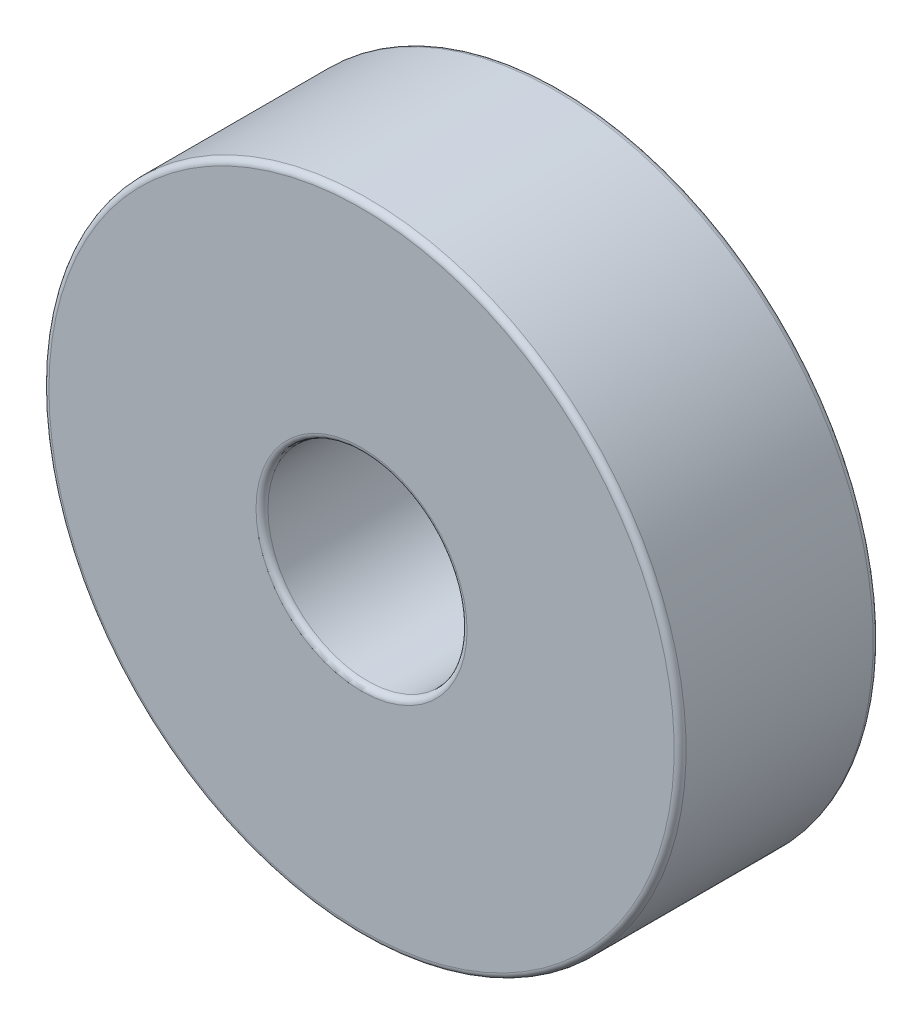
ISO-10303-21;
HEADER;
FILE_DESCRIPTION(('STEP AP214'),'2;1');
FILE_NAME('part.step','',(''),(''),'','','');
FILE_SCHEMA(('AUTOMOTIVE_DESIGN { 1 0 10303 214 1 1 1 1 }'));
ENDSEC;
DATA;
#1=APPLICATION_CONTEXT('core data for automotive mechanical design processes');
#2=APPLICATION_PROTOCOL_DEFINITION('international standard','automotive_design',2000,#1);
#3=PRODUCT_CONTEXT('',#1,'mechanical');
#4=PRODUCT('Part','Part','',(#3));
#5=PRODUCT_RELATED_PRODUCT_CATEGORY('part','',(#4));
#6=PRODUCT_DEFINITION_FORMATION('','',#4);
#7=PRODUCT_DEFINITION_CONTEXT('part definition',#1,'design');
#8=PRODUCT_DEFINITION('design','',#6,#7);
#9=PRODUCT_DEFINITION_SHAPE('','',#8);
#10=(LENGTH_UNIT() NAMED_UNIT(*) SI_UNIT(.MILLI.,.METRE.));
#11=(NAMED_UNIT(*) PLANE_ANGLE_UNIT() SI_UNIT($,.RADIAN.));
#12=(NAMED_UNIT(*) SI_UNIT($,.STERADIAN.) SOLID_ANGLE_UNIT());
#13=UNCERTAINTY_MEASURE_WITH_UNIT(LENGTH_MEASURE(1.E-05),#10,'distance_accuracy_value','');
#14=(GEOMETRIC_REPRESENTATION_CONTEXT(3) GLOBAL_UNCERTAINTY_ASSIGNED_CONTEXT((#13)) GLOBAL_UNIT_ASSIGNED_CONTEXT((#10,
#11,#12)) REPRESENTATION_CONTEXT('',''));
#15=CARTESIAN_POINT('',(0.,0.,0.));
#16=DIRECTION('',(0.,0.,1.));
#17=DIRECTION('',(1.,0.,0.));
#18=AXIS2_PLACEMENT_3D('',#15,#16,#17);
#19=CARTESIAN_POINT('',(0.,0.,-0.15));
#20=DIRECTION('',(0.,0.,-1.));
#21=DIRECTION('',(-1.,0.,0.));
#22=AXIS2_PLACEMENT_3D('',#19,#20,#21);
#23=TOROIDAL_SURFACE('',#22,2.65,0.15);
#24=CARTESIAN_POINT('',(0.,0.,-0.15));
#25=DIRECTION('',(0.,0.,-1.));
#26=DIRECTION('',(-1.,0.,0.));
#27=AXIS2_PLACEMENT_3D('',#24,#25,#26);
#28=CIRCLE('',#27,2.5);
#29=CARTESIAN_POINT('',(-2.5,0.,-0.15));
#30=VERTEX_POINT('',#29);
#31=EDGE_CURVE('E59',#30,#30,#28,.T.);
#32=ORIENTED_EDGE('',*,*,#31,.T.);
#33=EDGE_LOOP('',(#32));
#34=FACE_BOUND('',#33,.T.);
#35=CARTESIAN_POINT('',(0.,0.,0.));
#36=DIRECTION('',(0.,0.,-1.));
#37=DIRECTION('',(-1.,0.,0.));
#38=AXIS2_PLACEMENT_3D('',#35,#36,#37);
#39=CIRCLE('',#38,2.65);
#40=CARTESIAN_POINT('',(-2.65,0.,0.));
#41=VERTEX_POINT('',#40);
#42=EDGE_CURVE('E10',#41,#41,#39,.T.);
#43=ORIENTED_EDGE('',*,*,#42,.F.);
#44=EDGE_LOOP('',(#43));
#45=FACE_BOUND('',#44,.T.);
#46=ADVANCED_FACE('F31',(#34,#45),#23,.T.);
#47=CARTESIAN_POINT('',(0.,7.85,0.));
#48=DIRECTION('',(0.,0.,1.));
#49=DIRECTION('',(1.,0.,0.));
#50=AXIS2_PLACEMENT_3D('',#47,#48,#49);
#51=PLANE('',#50);
#52=ORIENTED_EDGE('',*,*,#42,.T.);
#53=EDGE_LOOP('',(#52));
#54=FACE_BOUND('',#53,.T.);
#55=CARTESIAN_POINT('',(0.,0.,0.));
#56=DIRECTION('',(0.,0.,-1.));
#57=DIRECTION('',(-1.,0.,0.));
#58=AXIS2_PLACEMENT_3D('',#55,#56,#57);
#59=CIRCLE('',#58,7.85);
#60=CARTESIAN_POINT('',(-7.85,0.,0.));
#61=VERTEX_POINT('',#60);
#62=EDGE_CURVE('E37',#61,#61,#59,.T.);
#63=ORIENTED_EDGE('',*,*,#62,.F.);
#64=EDGE_LOOP('',(#63));
#65=FACE_BOUND('',#64,.T.);
#66=ADVANCED_FACE('F77',(#54,#65),#51,.T.);
#67=CARTESIAN_POINT('',(0.,0.,-0.15));
#68=DIRECTION('',(0.,0.,-1.));
#69=DIRECTION('',(-1.,0.,0.));
#70=AXIS2_PLACEMENT_3D('',#67,#68,#69);
#71=TOROIDAL_SURFACE('',#70,7.85,0.150000000000001);
#72=ORIENTED_EDGE('',*,*,#62,.T.);
#73=EDGE_LOOP('',(#72));
#74=FACE_BOUND('',#73,.T.);
#75=CARTESIAN_POINT('',(0.,0.,-0.15));
#76=DIRECTION('',(0.,0.,-1.));
#77=DIRECTION('',(-1.,0.,0.));
#78=AXIS2_PLACEMENT_3D('',#75,#76,#77);
#79=CIRCLE('',#78,8.);
#80=CARTESIAN_POINT('',(-8.,0.,-0.15));
#81=VERTEX_POINT('',#80);
#82=EDGE_CURVE('E41',#81,#81,#79,.T.);
#83=ORIENTED_EDGE('',*,*,#82,.F.);
#84=EDGE_LOOP('',(#83));
#85=FACE_BOUND('',#84,.T.);
#86=ADVANCED_FACE('F81',(#74,#85),#71,.T.);
#87=CARTESIAN_POINT('',(0.,0.,0.));
#88=DIRECTION('',(0.,0.,-1.));
#89=DIRECTION('',(-1.,0.,0.));
#90=AXIS2_PLACEMENT_3D('',#87,#88,#89);
#91=CYLINDRICAL_SURFACE('',#90,8.);
#92=ORIENTED_EDGE('',*,*,#82,.T.);
#93=EDGE_LOOP('',(#92));
#94=FACE_BOUND('',#93,.T.);
#95=CARTESIAN_POINT('',(0.,0.,-4.85));
#96=DIRECTION('',(0.,0.,-1.));
#97=DIRECTION('',(-1.,0.,0.));
#98=AXIS2_PLACEMENT_3D('',#95,#96,#97);
#99=CIRCLE('',#98,8.);
#100=CARTESIAN_POINT('',(-8.,0.,-4.85));
#101=VERTEX_POINT('',#100);
#102=EDGE_CURVE('E45',#101,#101,#99,.T.);
#103=ORIENTED_EDGE('',*,*,#102,.F.);
#104=EDGE_LOOP('',(#103));
#105=FACE_BOUND('',#104,.T.);
#106=ADVANCED_FACE('F85',(#94,#105),#91,.T.);
#107=CARTESIAN_POINT('',(0.,0.,-4.85));
#108=DIRECTION('',(0.,0.,-1.));
#109=DIRECTION('',(-1.,0.,0.));
#110=AXIS2_PLACEMENT_3D('',#107,#108,#109);
#111=TOROIDAL_SURFACE('',#110,7.85,0.15);
#112=ORIENTED_EDGE('',*,*,#102,.T.);
#113=EDGE_LOOP('',(#112));
#114=FACE_BOUND('',#113,.T.);
#115=CARTESIAN_POINT('',(0.,0.,-5.));
#116=DIRECTION('',(0.,0.,-1.));
#117=DIRECTION('',(-1.,0.,0.));
#118=AXIS2_PLACEMENT_3D('',#115,#116,#117);
#119=CIRCLE('',#118,7.85);
#120=CARTESIAN_POINT('',(-7.85,0.,-5.));
#121=VERTEX_POINT('',#120);
#122=EDGE_CURVE('E50',#121,#121,#119,.T.);
#123=ORIENTED_EDGE('',*,*,#122,.F.);
#124=EDGE_LOOP('',(#123));
#125=FACE_BOUND('',#124,.T.);
#126=ADVANCED_FACE('F91',(#114,#125),#111,.T.);
#127=CARTESIAN_POINT('',(0.,2.65,-5.));
#128=DIRECTION('',(0.,0.,-1.));
#129=DIRECTION('',(-1.,0.,0.));
#130=AXIS2_PLACEMENT_3D('',#127,#128,#129);
#131=PLANE('',#130);
#132=ORIENTED_EDGE('',*,*,#122,.T.);
#133=EDGE_LOOP('',(#132));
#134=FACE_BOUND('',#133,.T.);
#135=CARTESIAN_POINT('',(0.,0.,-5.));
#136=DIRECTION('',(0.,0.,-1.));
#137=DIRECTION('',(-1.,0.,0.));
#138=AXIS2_PLACEMENT_3D('',#135,#136,#137);
#139=CIRCLE('',#138,2.65);
#140=CARTESIAN_POINT('',(-2.65,0.,-5.));
#141=VERTEX_POINT('',#140);
#142=EDGE_CURVE('E53',#141,#141,#139,.T.);
#143=ORIENTED_EDGE('',*,*,#142,.F.);
#144=EDGE_LOOP('',(#143));
#145=FACE_BOUND('',#144,.T.);
#146=ADVANCED_FACE('F73',(#134,#145),#131,.T.);
#147=CARTESIAN_POINT('',(0.,0.,-4.85));
#148=DIRECTION('',(0.,0.,-1.));
#149=DIRECTION('',(-1.,0.,0.));
#150=AXIS2_PLACEMENT_3D('',#147,#148,#149);
#151=TOROIDAL_SURFACE('',#150,2.65,0.15);
#152=ORIENTED_EDGE('',*,*,#142,.T.);
#153=EDGE_LOOP('',(#152));
#154=FACE_BOUND('',#153,.T.);
#155=CARTESIAN_POINT('',(0.,0.,-4.85));
#156=DIRECTION('',(0.,0.,-1.));
#157=DIRECTION('',(-1.,0.,0.));
#158=AXIS2_PLACEMENT_3D('',#155,#156,#157);
#159=CIRCLE('',#158,2.5);
#160=CARTESIAN_POINT('',(-2.5,0.,-4.85));
#161=VERTEX_POINT('',#160);
#162=EDGE_CURVE('E56',#161,#161,#159,.T.);
#163=ORIENTED_EDGE('',*,*,#162,.F.);
#164=EDGE_LOOP('',(#163));
#165=FACE_BOUND('',#164,.T.);
#166=ADVANCED_FACE('F67',(#154,#165),#151,.T.);
#167=CARTESIAN_POINT('',(0.,0.,0.));
#168=DIRECTION('',(0.,0.,-1.));
#169=DIRECTION('',(-1.,0.,0.));
#170=AXIS2_PLACEMENT_3D('',#167,#168,#169);
#171=CYLINDRICAL_SURFACE('',#170,2.5);
#172=ORIENTED_EDGE('',*,*,#162,.T.);
#173=EDGE_LOOP('',(#172));
#174=FACE_BOUND('',#173,.T.);
#175=ORIENTED_EDGE('',*,*,#31,.F.);
#176=EDGE_LOOP('',(#175));
#177=FACE_BOUND('',#176,.T.);
#178=ADVANCED_FACE('F65',(#174,#177),#171,.F.);
#179=CLOSED_SHELL('',(#46,#66,#86,#106,#126,#146,#166,#178));
#180=MANIFOLD_SOLID_BREP('B2',#179);
#181=ADVANCED_BREP_SHAPE_REPRESENTATION('',(#18,#180),#14);
#182=SHAPE_DEFINITION_REPRESENTATION(#9,#181);
ENDSEC;
END-ISO-10303-21;
